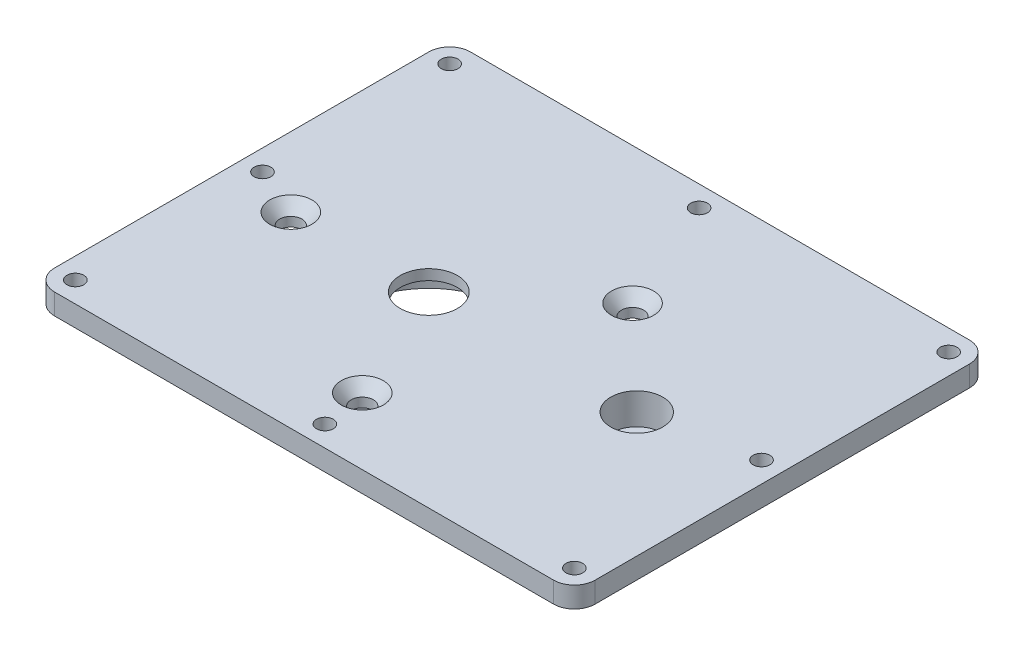
ISO-10303-21;
HEADER;
FILE_DESCRIPTION(('STEP AP214'),'2;1');
FILE_NAME('part.step','',(''),(''),'','','');
FILE_SCHEMA(('AUTOMOTIVE_DESIGN { 1 0 10303 214 1 1 1 1 }'));
ENDSEC;
DATA;
#1=APPLICATION_CONTEXT('core data for automotive mechanical design processes');
#2=APPLICATION_PROTOCOL_DEFINITION('international standard','automotive_design',2000,#1);
#3=PRODUCT_CONTEXT('',#1,'mechanical');
#4=PRODUCT('Part','Part','',(#3));
#5=PRODUCT_RELATED_PRODUCT_CATEGORY('part','',(#4));
#6=PRODUCT_DEFINITION_FORMATION('','',#4);
#7=PRODUCT_DEFINITION_CONTEXT('part definition',#1,'design');
#8=PRODUCT_DEFINITION('design','',#6,#7);
#9=PRODUCT_DEFINITION_SHAPE('','',#8);
#10=(LENGTH_UNIT() NAMED_UNIT(*) SI_UNIT(.MILLI.,.METRE.));
#11=(NAMED_UNIT(*) PLANE_ANGLE_UNIT() SI_UNIT($,.RADIAN.));
#12=(NAMED_UNIT(*) SI_UNIT($,.STERADIAN.) SOLID_ANGLE_UNIT());
#13=UNCERTAINTY_MEASURE_WITH_UNIT(LENGTH_MEASURE(1.E-05),#10,'distance_accuracy_value','');
#14=(GEOMETRIC_REPRESENTATION_CONTEXT(3) GLOBAL_UNCERTAINTY_ASSIGNED_CONTEXT((#13)) GLOBAL_UNIT_ASSIGNED_CONTEXT((#10,
#11,#12)) REPRESENTATION_CONTEXT('',''));
#15=CARTESIAN_POINT('',(0.,0.,0.));
#16=DIRECTION('',(0.,0.,1.));
#17=DIRECTION('',(1.,0.,0.));
#18=AXIS2_PLACEMENT_3D('',#15,#16,#17);
#19=CARTESIAN_POINT('',(44.45,6.35,6.35));
#20=DIRECTION('',(0.,-1.,0.));
#21=DIRECTION('',(0.,0.,-1.));
#22=AXIS2_PLACEMENT_3D('',#19,#20,#21);
#23=CYLINDRICAL_SURFACE('',#22,7.9375);
#24=CARTESIAN_POINT('',(44.45,6.35,6.35));
#25=DIRECTION('',(0.,1.,0.));
#26=DIRECTION('',(0.,0.,1.));
#27=AXIS2_PLACEMENT_3D('',#24,#25,#26);
#28=CIRCLE('',#27,7.9375);
#29=CARTESIAN_POINT('',(44.45,6.35,14.2875));
#30=VERTEX_POINT('',#29);
#31=EDGE_CURVE('E142',#30,#30,#28,.T.);
#32=ORIENTED_EDGE('',*,*,#31,.T.);
#33=EDGE_LOOP('',(#32));
#34=FACE_BOUND('',#33,.T.);
#35=CARTESIAN_POINT('',(44.45,-3.175,6.35));
#36=DIRECTION('',(0.,-1.,0.));
#37=DIRECTION('',(0.,0.,-1.));
#38=AXIS2_PLACEMENT_3D('',#35,#36,#37);
#39=CIRCLE('',#38,7.9375);
#40=CARTESIAN_POINT('',(44.45,-3.175,-1.5875));
#41=VERTEX_POINT('',#40);
#42=EDGE_CURVE('E151',#41,#41,#39,.T.);
#43=ORIENTED_EDGE('',*,*,#42,.T.);
#44=EDGE_LOOP('',(#43));
#45=FACE_BOUND('',#44,.T.);
#46=ADVANCED_FACE('F36',(#34,#45),#23,.F.);
#47=CARTESIAN_POINT('',(0.,6.35,0.));
#48=DIRECTION('',(0.,1.,0.));
#49=DIRECTION('',(0.,0.,1.));
#50=AXIS2_PLACEMENT_3D('',#47,#48,#49);
#51=PLANE('',#50);
#52=CARTESIAN_POINT('',(-76.2,6.35,57.15));
#53=DIRECTION('',(0.,1.,0.));
#54=DIRECTION('',(0.,0.,1.));
#55=AXIS2_PLACEMENT_3D('',#52,#53,#54);
#56=CIRCLE('',#55,2.55269999999999);
#57=CARTESIAN_POINT('',(-76.2,6.35,59.7027));
#58=VERTEX_POINT('',#57);
#59=EDGE_CURVE('E410',#58,#58,#56,.T.);
#60=ORIENTED_EDGE('',*,*,#59,.F.);
#61=EDGE_LOOP('',(#60));
#62=FACE_BOUND('',#61,.T.);
#63=CARTESIAN_POINT('',(-76.2,6.35,-57.15));
#64=DIRECTION('',(0.,1.,0.));
#65=DIRECTION('',(0.,0.,1.));
#66=AXIS2_PLACEMENT_3D('',#63,#64,#65);
#67=CIRCLE('',#66,2.55269999999999);
#68=CARTESIAN_POINT('',(-76.2,6.35,-54.5973));
#69=VERTEX_POINT('',#68);
#70=EDGE_CURVE('E411',#69,#69,#67,.T.);
#71=ORIENTED_EDGE('',*,*,#70,.F.);
#72=EDGE_LOOP('',(#71));
#73=FACE_BOUND('',#72,.T.);
#74=CARTESIAN_POINT('',(76.2,6.35,-57.15));
#75=DIRECTION('',(0.,1.,0.));
#76=DIRECTION('',(0.,0.,1.));
#77=AXIS2_PLACEMENT_3D('',#74,#75,#76);
#78=CIRCLE('',#77,2.55269999999999);
#79=CARTESIAN_POINT('',(76.2,6.35,-54.5973));
#80=VERTEX_POINT('',#79);
#81=EDGE_CURVE('E418',#80,#80,#78,.T.);
#82=ORIENTED_EDGE('',*,*,#81,.F.);
#83=EDGE_LOOP('',(#82));
#84=FACE_BOUND('',#83,.T.);
#85=CARTESIAN_POINT('',(76.2,6.35,57.15));
#86=DIRECTION('',(0.,1.,0.));
#87=DIRECTION('',(0.,0.,1.));
#88=AXIS2_PLACEMENT_3D('',#85,#86,#87);
#89=CIRCLE('',#88,2.55269999999999);
#90=CARTESIAN_POINT('',(76.2,6.35,59.7027));
#91=VERTEX_POINT('',#90);
#92=EDGE_CURVE('E422',#91,#91,#89,.T.);
#93=ORIENTED_EDGE('',*,*,#92,.F.);
#94=EDGE_LOOP('',(#93));
#95=FACE_BOUND('',#94,.T.);
#96=CARTESIAN_POINT('',(0.,6.35,-57.15));
#97=DIRECTION('',(0.,1.,0.));
#98=DIRECTION('',(0.,0.,1.));
#99=AXIS2_PLACEMENT_3D('',#96,#97,#98);
#100=CIRCLE('',#99,2.5527);
#101=CARTESIAN_POINT('',(0.,6.35,-54.5973));
#102=VERTEX_POINT('',#101);
#103=EDGE_CURVE('E426',#102,#102,#100,.T.);
#104=ORIENTED_EDGE('',*,*,#103,.F.);
#105=EDGE_LOOP('',(#104));
#106=FACE_BOUND('',#105,.T.);
#107=CARTESIAN_POINT('',(0.,6.35,57.15));
#108=DIRECTION('',(0.,1.,0.));
#109=DIRECTION('',(0.,0.,1.));
#110=AXIS2_PLACEMENT_3D('',#107,#108,#109);
#111=CIRCLE('',#110,2.5527);
#112=CARTESIAN_POINT('',(0.,6.35,59.7027));
#113=VERTEX_POINT('',#112);
#114=EDGE_CURVE('E429',#113,#113,#111,.T.);
#115=ORIENTED_EDGE('',*,*,#114,.F.);
#116=EDGE_LOOP('',(#115));
#117=FACE_BOUND('',#116,.T.);
#118=CARTESIAN_POINT('',(-76.2,6.35,0.));
#119=DIRECTION('',(0.,1.,0.));
#120=DIRECTION('',(0.,0.,1.));
#121=AXIS2_PLACEMENT_3D('',#118,#119,#120);
#122=CIRCLE('',#121,2.55269999999999);
#123=CARTESIAN_POINT('',(-76.2,6.35,2.55270000000001));
#124=VERTEX_POINT('',#123);
#125=EDGE_CURVE('E197',#124,#124,#122,.T.);
#126=ORIENTED_EDGE('',*,*,#125,.F.);
#127=EDGE_LOOP('',(#126));
#128=FACE_BOUND('',#127,.T.);
#129=CARTESIAN_POINT('',(76.2,6.35,0.));
#130=DIRECTION('',(0.,1.,0.));
#131=DIRECTION('',(0.,0.,1.));
#132=AXIS2_PLACEMENT_3D('',#129,#130,#131);
#133=CIRCLE('',#132,2.55269999999999);
#134=CARTESIAN_POINT('',(76.2,6.35,2.55269999999998));
#135=VERTEX_POINT('',#134);
#136=EDGE_CURVE('E186',#135,#135,#133,.T.);
#137=ORIENTED_EDGE('',*,*,#136,.F.);
#138=EDGE_LOOP('',(#137));
#139=FACE_BOUND('',#138,.T.);
#140=CARTESIAN_POINT('',(-61.2556864717363,6.35,6.29123306272272));
#141=DIRECTION('',(0.,1.,0.));
#142=DIRECTION('',(0.,0.,1.));
#143=AXIS2_PLACEMENT_3D('',#140,#141,#142);
#144=CIRCLE('',#143,6.4389);
#145=CARTESIAN_POINT('',(-61.2556864717363,6.35,12.7301330627227));
#146=VERTEX_POINT('',#145);
#147=EDGE_CURVE('E185',#146,#146,#144,.T.);
#148=ORIENTED_EDGE('',*,*,#147,.F.);
#149=EDGE_LOOP('',(#148));
#150=FACE_BOUND('',#149,.T.);
#151=CARTESIAN_POINT('',(15.0155713082004,6.35,-21.8002894425893));
#152=DIRECTION('',(0.,1.,0.));
#153=DIRECTION('',(0.,0.,1.));
#154=AXIS2_PLACEMENT_3D('',#151,#152,#153);
#155=CIRCLE('',#154,6.4389);
#156=CARTESIAN_POINT('',(15.0155713082004,6.35,-15.3613894425893));
#157=VERTEX_POINT('',#156);
#158=EDGE_CURVE('E161',#157,#157,#155,.T.);
#159=ORIENTED_EDGE('',*,*,#158,.F.);
#160=EDGE_LOOP('',(#159));
#161=FACE_BOUND('',#160,.T.);
#162=CARTESIAN_POINT('',(-2.53999999999999,6.35,43.18));
#163=DIRECTION('',(0.,1.,0.));
#164=DIRECTION('',(0.,0.,1.));
#165=AXIS2_PLACEMENT_3D('',#162,#163,#164);
#166=CIRCLE('',#165,6.4389);
#167=CARTESIAN_POINT('',(-2.53999999999999,6.35,49.6189));
#168=VERTEX_POINT('',#167);
#169=EDGE_CURVE('E156',#168,#168,#166,.T.);
#170=ORIENTED_EDGE('',*,*,#169,.F.);
#171=EDGE_LOOP('',(#170));
#172=FACE_BOUND('',#171,.T.);
#173=CARTESIAN_POINT('',(-19.05,6.35,6.35));
#174=DIRECTION('',(0.,-1.,0.));
#175=DIRECTION('',(0.,0.,-1.));
#176=AXIS2_PLACEMENT_3D('',#173,#174,#175);
#177=CIRCLE('',#176,8.73125);
#178=CARTESIAN_POINT('',(-19.05,6.35,-2.38125));
#179=VERTEX_POINT('',#178);
#180=EDGE_CURVE('E222',#179,#179,#177,.T.);
#181=ORIENTED_EDGE('',*,*,#180,.T.);
#182=EDGE_LOOP('',(#181));
#183=FACE_BOUND('',#182,.T.);
#184=DIRECTION('',(0.,0.,-1.));
#185=VECTOR('',#184,1.);
#186=CARTESIAN_POINT('',(82.55,6.35,63.5));
#187=LINE('',#186,#185);
#188=CARTESIAN_POINT('',(82.55,6.35,57.15));
#189=VERTEX_POINT('',#188);
#190=CARTESIAN_POINT('',(82.55,6.35,-57.15));
#191=VERTEX_POINT('',#190);
#192=EDGE_CURVE('E233',#189,#191,#187,.T.);
#193=ORIENTED_EDGE('',*,*,#192,.T.);
#194=CARTESIAN_POINT('',(76.2,6.35,-57.15));
#195=DIRECTION('',(0.,1.,0.));
#196=DIRECTION('',(0.,0.,1.));
#197=AXIS2_PLACEMENT_3D('',#194,#195,#196);
#198=CIRCLE('',#197,6.35);
#199=CARTESIAN_POINT('',(76.2,6.35,-63.5));
#200=VERTEX_POINT('',#199);
#201=EDGE_CURVE('E176',#191,#200,#198,.T.);
#202=ORIENTED_EDGE('',*,*,#201,.T.);
#203=DIRECTION('',(-1.,0.,0.));
#204=VECTOR('',#203,1.);
#205=CARTESIAN_POINT('',(82.55,6.35,-63.5));
#206=LINE('',#205,#204);
#207=CARTESIAN_POINT('',(-76.2,6.35,-63.5));
#208=VERTEX_POINT('',#207);
#209=EDGE_CURVE('E124',#200,#208,#206,.T.);
#210=ORIENTED_EDGE('',*,*,#209,.T.);
#211=CARTESIAN_POINT('',(-76.2,6.35,-57.15));
#212=DIRECTION('',(0.,1.,0.));
#213=DIRECTION('',(0.,0.,1.));
#214=AXIS2_PLACEMENT_3D('',#211,#212,#213);
#215=CIRCLE('',#214,6.35);
#216=CARTESIAN_POINT('',(-82.55,6.35,-57.15));
#217=VERTEX_POINT('',#216);
#218=EDGE_CURVE('E171',#208,#217,#215,.T.);
#219=ORIENTED_EDGE('',*,*,#218,.T.);
#220=DIRECTION('',(0.,0.,1.));
#221=VECTOR('',#220,1.);
#222=CARTESIAN_POINT('',(-82.55,6.35,63.5));
#223=LINE('',#222,#221);
#224=CARTESIAN_POINT('',(-82.55,6.35,57.15));
#225=VERTEX_POINT('',#224);
#226=EDGE_CURVE('E130',#217,#225,#223,.T.);
#227=ORIENTED_EDGE('',*,*,#226,.T.);
#228=CARTESIAN_POINT('',(-76.2,6.35,57.15));
#229=DIRECTION('',(0.,1.,0.));
#230=DIRECTION('',(0.,0.,1.));
#231=AXIS2_PLACEMENT_3D('',#228,#229,#230);
#232=CIRCLE('',#231,6.35);
#233=CARTESIAN_POINT('',(-76.2,6.35,63.5));
#234=VERTEX_POINT('',#233);
#235=EDGE_CURVE('E60',#225,#234,#232,.T.);
#236=ORIENTED_EDGE('',*,*,#235,.T.);
#237=DIRECTION('',(1.,0.,0.));
#238=VECTOR('',#237,1.);
#239=CARTESIAN_POINT('',(82.55,6.35,63.5));
#240=LINE('',#239,#238);
#241=CARTESIAN_POINT('',(76.2,6.35,63.5));
#242=VERTEX_POINT('',#241);
#243=EDGE_CURVE('E133',#234,#242,#240,.T.);
#244=ORIENTED_EDGE('',*,*,#243,.T.);
#245=CARTESIAN_POINT('',(76.2,6.35,57.15));
#246=DIRECTION('',(0.,1.,0.));
#247=DIRECTION('',(0.,0.,1.));
#248=AXIS2_PLACEMENT_3D('',#245,#246,#247);
#249=CIRCLE('',#248,6.35);
#250=EDGE_CURVE('E174',#242,#189,#249,.T.);
#251=ORIENTED_EDGE('',*,*,#250,.T.);
#252=EDGE_LOOP('',(#193,#202,#210,#219,#227,#236,#244,#251));
#253=FACE_BOUND('',#252,.T.);
#254=ORIENTED_EDGE('',*,*,#31,.F.);
#255=EDGE_LOOP('',(#254));
#256=FACE_BOUND('',#255,.T.);
#257=ADVANCED_FACE('F246',(#62,#73,#84,#95,#106,#117,#128,#139,#150,#161,#172,#183,#253,#256),
#51,.T.);
#258=CARTESIAN_POINT('',(0.,0.,0.));
#259=DIRECTION('',(0.,1.,0.));
#260=DIRECTION('',(0.,0.,1.));
#261=AXIS2_PLACEMENT_3D('',#258,#259,#260);
#262=PLANE('',#261);
#263=CARTESIAN_POINT('',(-76.2,0.,57.15));
#264=DIRECTION('',(0.,1.,0.));
#265=DIRECTION('',(0.,0.,1.));
#266=AXIS2_PLACEMENT_3D('',#263,#264,#265);
#267=CIRCLE('',#266,2.55269999999999);
#268=CARTESIAN_POINT('',(-76.2,0.,59.7027));
#269=VERTEX_POINT('',#268);
#270=EDGE_CURVE('E282',#269,#269,#267,.T.);
#271=ORIENTED_EDGE('',*,*,#270,.T.);
#272=EDGE_LOOP('',(#271));
#273=FACE_BOUND('',#272,.T.);
#274=CARTESIAN_POINT('',(-76.2,0.,-57.15));
#275=DIRECTION('',(0.,1.,0.));
#276=DIRECTION('',(0.,0.,1.));
#277=AXIS2_PLACEMENT_3D('',#274,#275,#276);
#278=CIRCLE('',#277,2.55269999999999);
#279=CARTESIAN_POINT('',(-76.2,0.,-54.5973));
#280=VERTEX_POINT('',#279);
#281=EDGE_CURVE('E286',#280,#280,#278,.T.);
#282=ORIENTED_EDGE('',*,*,#281,.T.);
#283=EDGE_LOOP('',(#282));
#284=FACE_BOUND('',#283,.T.);
#285=CARTESIAN_POINT('',(76.2,0.,-57.15));
#286=DIRECTION('',(0.,1.,0.));
#287=DIRECTION('',(0.,0.,1.));
#288=AXIS2_PLACEMENT_3D('',#285,#286,#287);
#289=CIRCLE('',#288,2.55269999999999);
#290=CARTESIAN_POINT('',(76.2,0.,-54.5973));
#291=VERTEX_POINT('',#290);
#292=EDGE_CURVE('E290',#291,#291,#289,.T.);
#293=ORIENTED_EDGE('',*,*,#292,.T.);
#294=EDGE_LOOP('',(#293));
#295=FACE_BOUND('',#294,.T.);
#296=CARTESIAN_POINT('',(76.2,0.,57.15));
#297=DIRECTION('',(0.,1.,0.));
#298=DIRECTION('',(0.,0.,1.));
#299=AXIS2_PLACEMENT_3D('',#296,#297,#298);
#300=CIRCLE('',#299,2.55269999999999);
#301=CARTESIAN_POINT('',(76.2,0.,59.7027));
#302=VERTEX_POINT('',#301);
#303=EDGE_CURVE('E294',#302,#302,#300,.T.);
#304=ORIENTED_EDGE('',*,*,#303,.T.);
#305=EDGE_LOOP('',(#304));
#306=FACE_BOUND('',#305,.T.);
#307=CARTESIAN_POINT('',(0.,0.,-57.15));
#308=DIRECTION('',(0.,1.,0.));
#309=DIRECTION('',(0.,0.,1.));
#310=AXIS2_PLACEMENT_3D('',#307,#308,#309);
#311=CIRCLE('',#310,2.5527);
#312=CARTESIAN_POINT('',(0.,0.,-54.5973));
#313=VERTEX_POINT('',#312);
#314=EDGE_CURVE('E40',#313,#313,#311,.T.);
#315=ORIENTED_EDGE('',*,*,#314,.T.);
#316=EDGE_LOOP('',(#315));
#317=FACE_BOUND('',#316,.T.);
#318=CARTESIAN_POINT('',(0.,0.,57.15));
#319=DIRECTION('',(0.,1.,0.));
#320=DIRECTION('',(0.,0.,1.));
#321=AXIS2_PLACEMENT_3D('',#318,#319,#320);
#322=CIRCLE('',#321,2.5527);
#323=CARTESIAN_POINT('',(0.,0.,59.7027));
#324=VERTEX_POINT('',#323);
#325=EDGE_CURVE('E301',#324,#324,#322,.T.);
#326=ORIENTED_EDGE('',*,*,#325,.T.);
#327=EDGE_LOOP('',(#326));
#328=FACE_BOUND('',#327,.T.);
#329=CARTESIAN_POINT('',(-76.2,0.,0.));
#330=DIRECTION('',(0.,1.,0.));
#331=DIRECTION('',(0.,0.,1.));
#332=AXIS2_PLACEMENT_3D('',#329,#330,#331);
#333=CIRCLE('',#332,2.55269999999999);
#334=CARTESIAN_POINT('',(-76.2,0.,2.55270000000001));
#335=VERTEX_POINT('',#334);
#336=EDGE_CURVE('E192',#335,#335,#333,.T.);
#337=ORIENTED_EDGE('',*,*,#336,.T.);
#338=EDGE_LOOP('',(#337));
#339=FACE_BOUND('',#338,.T.);
#340=CARTESIAN_POINT('',(76.2,0.,0.));
#341=DIRECTION('',(0.,1.,0.));
#342=DIRECTION('',(0.,0.,1.));
#343=AXIS2_PLACEMENT_3D('',#340,#341,#342);
#344=CIRCLE('',#343,2.55269999999999);
#345=CARTESIAN_POINT('',(76.2,0.,2.55269999999998));
#346=VERTEX_POINT('',#345);
#347=EDGE_CURVE('E183',#346,#346,#344,.T.);
#348=ORIENTED_EDGE('',*,*,#347,.T.);
#349=EDGE_LOOP('',(#348));
#350=FACE_BOUND('',#349,.T.);
#351=CARTESIAN_POINT('',(-61.2556864717363,0.,6.29123306272272));
#352=DIRECTION('',(0.,1.,0.));
#353=DIRECTION('',(0.,0.,1.));
#354=AXIS2_PLACEMENT_3D('',#351,#352,#353);
#355=CIRCLE('',#354,3.3782);
#356=CARTESIAN_POINT('',(-61.2556864717363,0.,9.66943306272272));
#357=VERTEX_POINT('',#356);
#358=EDGE_CURVE('E158',#357,#357,#355,.T.);
#359=ORIENTED_EDGE('',*,*,#358,.T.);
#360=EDGE_LOOP('',(#359));
#361=FACE_BOUND('',#360,.T.);
#362=CARTESIAN_POINT('',(15.0155713082004,0.,-21.8002894425893));
#363=DIRECTION('',(0.,1.,0.));
#364=DIRECTION('',(0.,0.,1.));
#365=AXIS2_PLACEMENT_3D('',#362,#363,#364);
#366=CIRCLE('',#365,3.3782);
#367=CARTESIAN_POINT('',(15.0155713082004,0.,-18.4220894425893));
#368=VERTEX_POINT('',#367);
#369=EDGE_CURVE('E153',#368,#368,#366,.T.);
#370=ORIENTED_EDGE('',*,*,#369,.T.);
#371=EDGE_LOOP('',(#370));
#372=FACE_BOUND('',#371,.T.);
#373=CARTESIAN_POINT('',(-2.53999999999999,0.,43.18));
#374=DIRECTION('',(0.,1.,0.));
#375=DIRECTION('',(0.,0.,1.));
#376=AXIS2_PLACEMENT_3D('',#373,#374,#375);
#377=CIRCLE('',#376,3.3782);
#378=CARTESIAN_POINT('',(-2.53999999999999,0.,46.5582));
#379=VERTEX_POINT('',#378);
#380=EDGE_CURVE('E148',#379,#379,#377,.T.);
#381=ORIENTED_EDGE('',*,*,#380,.T.);
#382=EDGE_LOOP('',(#381));
#383=FACE_BOUND('',#382,.T.);
#384=CARTESIAN_POINT('',(44.45,0.,6.35));
#385=DIRECTION('',(0.,1.,0.));
#386=DIRECTION('',(0.,0.,1.));
#387=AXIS2_PLACEMENT_3D('',#384,#385,#386);
#388=CIRCLE('',#387,12.7);
#389=CARTESIAN_POINT('',(44.45,0.,19.05));
#390=VERTEX_POINT('',#389);
#391=EDGE_CURVE('E144',#390,#390,#388,.T.);
#392=ORIENTED_EDGE('',*,*,#391,.T.);
#393=EDGE_LOOP('',(#392));
#394=FACE_BOUND('',#393,.T.);
#395=CARTESIAN_POINT('',(-19.05,0.,6.35));
#396=DIRECTION('',(0.,1.,0.));
#397=DIRECTION('',(0.,0.,1.));
#398=AXIS2_PLACEMENT_3D('',#395,#396,#397);
#399=CIRCLE('',#398,28.575);
#400=CARTESIAN_POINT('',(-19.05,0.,34.925));
#401=VERTEX_POINT('',#400);
#402=EDGE_CURVE('E139',#401,#401,#399,.T.);
#403=ORIENTED_EDGE('',*,*,#402,.T.);
#404=EDGE_LOOP('',(#403));
#405=FACE_BOUND('',#404,.T.);
#406=DIRECTION('',(-1.,0.,0.));
#407=VECTOR('',#406,1.);
#408=CARTESIAN_POINT('',(82.55,0.,-63.5));
#409=LINE('',#408,#407);
#410=CARTESIAN_POINT('',(76.2,0.,-63.5));
#411=VERTEX_POINT('',#410);
#412=CARTESIAN_POINT('',(-76.2,0.,-63.5));
#413=VERTEX_POINT('',#412);
#414=EDGE_CURVE('E121',#411,#413,#409,.T.);
#415=ORIENTED_EDGE('',*,*,#414,.F.);
#416=CARTESIAN_POINT('',(76.2,0.,-57.15));
#417=DIRECTION('',(0.,1.,0.));
#418=DIRECTION('',(0.,0.,1.));
#419=AXIS2_PLACEMENT_3D('',#416,#417,#418);
#420=CIRCLE('',#419,6.35);
#421=CARTESIAN_POINT('',(82.55,0.,-57.15));
#422=VERTEX_POINT('',#421);
#423=EDGE_CURVE('E104',#411,#422,#420,.F.);
#424=ORIENTED_EDGE('',*,*,#423,.T.);
#425=DIRECTION('',(0.,0.,-1.));
#426=VECTOR('',#425,1.);
#427=CARTESIAN_POINT('',(82.55,0.,63.5));
#428=LINE('',#427,#426);
#429=CARTESIAN_POINT('',(82.55,0.,57.15));
#430=VERTEX_POINT('',#429);
#431=EDGE_CURVE('E131',#430,#422,#428,.T.);
#432=ORIENTED_EDGE('',*,*,#431,.F.);
#433=CARTESIAN_POINT('',(76.2,0.,57.15));
#434=DIRECTION('',(0.,1.,0.));
#435=DIRECTION('',(0.,0.,1.));
#436=AXIS2_PLACEMENT_3D('',#433,#434,#435);
#437=CIRCLE('',#436,6.35);
#438=CARTESIAN_POINT('',(76.2,0.,63.5));
#439=VERTEX_POINT('',#438);
#440=EDGE_CURVE('E115',#430,#439,#437,.F.);
#441=ORIENTED_EDGE('',*,*,#440,.T.);
#442=DIRECTION('',(1.,0.,0.));
#443=VECTOR('',#442,1.);
#444=CARTESIAN_POINT('',(82.55,0.,63.5));
#445=LINE('',#444,#443);
#446=CARTESIAN_POINT('',(-76.2,0.,63.5));
#447=VERTEX_POINT('',#446);
#448=EDGE_CURVE('E135',#447,#439,#445,.T.);
#449=ORIENTED_EDGE('',*,*,#448,.F.);
#450=CARTESIAN_POINT('',(-76.2,0.,57.15));
#451=DIRECTION('',(0.,1.,0.));
#452=DIRECTION('',(0.,0.,1.));
#453=AXIS2_PLACEMENT_3D('',#450,#451,#452);
#454=CIRCLE('',#453,6.35);
#455=CARTESIAN_POINT('',(-82.55,0.,57.15));
#456=VERTEX_POINT('',#455);
#457=EDGE_CURVE('E165',#447,#456,#454,.F.);
#458=ORIENTED_EDGE('',*,*,#457,.T.);
#459=DIRECTION('',(0.,0.,1.));
#460=VECTOR('',#459,1.);
#461=CARTESIAN_POINT('',(-82.55,0.,63.5));
#462=LINE('',#461,#460);
#463=CARTESIAN_POINT('',(-82.55,0.,-57.15));
#464=VERTEX_POINT('',#463);
#465=EDGE_CURVE('E230',#464,#456,#462,.T.);
#466=ORIENTED_EDGE('',*,*,#465,.F.);
#467=CARTESIAN_POINT('',(-76.2,0.,-57.15));
#468=DIRECTION('',(0.,1.,0.));
#469=DIRECTION('',(0.,0.,1.));
#470=AXIS2_PLACEMENT_3D('',#467,#468,#469);
#471=CIRCLE('',#470,6.35);
#472=EDGE_CURVE('E125',#464,#413,#471,.F.);
#473=ORIENTED_EDGE('',*,*,#472,.T.);
#474=EDGE_LOOP('',(#415,#424,#432,#441,#449,#458,#466,#473));
#475=FACE_BOUND('',#474,.T.);
#476=ADVANCED_FACE('F128',(#273,#284,#295,#306,#317,#328,#339,#350,#361,#372,#383,#394,#405,
#475),#262,.F.);
#477=CARTESIAN_POINT('',(-82.55,6.35,63.5));
#478=DIRECTION('',(1.,0.,0.));
#479=DIRECTION('',(0.,0.,-1.));
#480=AXIS2_PLACEMENT_3D('',#477,#478,#479);
#481=PLANE('',#480);
#482=ORIENTED_EDGE('',*,*,#465,.T.);
#483=DIRECTION('',(0.,-1.,0.));
#484=VECTOR('',#483,1.);
#485=CARTESIAN_POINT('',(-82.55,6.35,57.15));
#486=LINE('',#485,#484);
#487=EDGE_CURVE('E12',#456,#225,#486,.F.);
#488=ORIENTED_EDGE('',*,*,#487,.T.);
#489=ORIENTED_EDGE('',*,*,#226,.F.);
#490=DIRECTION('',(0.,-1.,0.));
#491=VECTOR('',#490,1.);
#492=CARTESIAN_POINT('',(-82.55,6.35,-57.15));
#493=LINE('',#492,#491);
#494=EDGE_CURVE('E45',#217,#464,#493,.T.);
#495=ORIENTED_EDGE('',*,*,#494,.T.);
#496=EDGE_LOOP('',(#482,#488,#489,#495));
#497=FACE_BOUND('',#496,.T.);
#498=ADVANCED_FACE('F258',(#497),#481,.F.);
#499=CARTESIAN_POINT('',(82.55,6.35,63.5));
#500=DIRECTION('',(0.,0.,-1.));
#501=DIRECTION('',(-1.,0.,0.));
#502=AXIS2_PLACEMENT_3D('',#499,#500,#501);
#503=PLANE('',#502);
#504=ORIENTED_EDGE('',*,*,#448,.T.);
#505=DIRECTION('',(0.,-1.,0.));
#506=VECTOR('',#505,1.);
#507=CARTESIAN_POINT('',(76.2,6.35,63.5));
#508=LINE('',#507,#506);
#509=EDGE_CURVE('E53',#439,#242,#508,.F.);
#510=ORIENTED_EDGE('',*,*,#509,.T.);
#511=ORIENTED_EDGE('',*,*,#243,.F.);
#512=DIRECTION('',(0.,-1.,0.));
#513=VECTOR('',#512,1.);
#514=CARTESIAN_POINT('',(-76.2,6.35,63.5));
#515=LINE('',#514,#513);
#516=EDGE_CURVE('E178',#234,#447,#515,.T.);
#517=ORIENTED_EDGE('',*,*,#516,.T.);
#518=EDGE_LOOP('',(#504,#510,#511,#517));
#519=FACE_BOUND('',#518,.T.);
#520=ADVANCED_FACE('F239',(#519),#503,.F.);
#521=CARTESIAN_POINT('',(82.55,6.35,63.5));
#522=DIRECTION('',(-1.,0.,0.));
#523=DIRECTION('',(0.,0.,1.));
#524=AXIS2_PLACEMENT_3D('',#521,#522,#523);
#525=PLANE('',#524);
#526=ORIENTED_EDGE('',*,*,#431,.T.);
#527=DIRECTION('',(0.,-1.,0.));
#528=VECTOR('',#527,1.);
#529=CARTESIAN_POINT('',(82.55,6.35,-57.15));
#530=LINE('',#529,#528);
#531=EDGE_CURVE('E109',#422,#191,#530,.F.);
#532=ORIENTED_EDGE('',*,*,#531,.T.);
#533=ORIENTED_EDGE('',*,*,#192,.F.);
#534=DIRECTION('',(0.,-1.,0.));
#535=VECTOR('',#534,1.);
#536=CARTESIAN_POINT('',(82.55,6.35,57.15));
#537=LINE('',#536,#535);
#538=EDGE_CURVE('E114',#189,#430,#537,.T.);
#539=ORIENTED_EDGE('',*,*,#538,.T.);
#540=EDGE_LOOP('',(#526,#532,#533,#539));
#541=FACE_BOUND('',#540,.T.);
#542=ADVANCED_FACE('F249',(#541),#525,.F.);
#543=CARTESIAN_POINT('',(82.55,6.35,-63.5));
#544=DIRECTION('',(0.,0.,1.));
#545=DIRECTION('',(1.,0.,0.));
#546=AXIS2_PLACEMENT_3D('',#543,#544,#545);
#547=PLANE('',#546);
#548=ORIENTED_EDGE('',*,*,#209,.F.);
#549=DIRECTION('',(0.,-1.,0.));
#550=VECTOR('',#549,1.);
#551=CARTESIAN_POINT('',(76.2,6.35,-63.5));
#552=LINE('',#551,#550);
#553=EDGE_CURVE('E108',#200,#411,#552,.T.);
#554=ORIENTED_EDGE('',*,*,#553,.T.);
#555=ORIENTED_EDGE('',*,*,#414,.T.);
#556=DIRECTION('',(0.,-1.,0.));
#557=VECTOR('',#556,1.);
#558=CARTESIAN_POINT('',(-76.2,6.35,-63.5));
#559=LINE('',#558,#557);
#560=EDGE_CURVE('E126',#413,#208,#559,.F.);
#561=ORIENTED_EDGE('',*,*,#560,.T.);
#562=EDGE_LOOP('',(#548,#554,#555,#561));
#563=FACE_BOUND('',#562,.T.);
#564=ADVANCED_FACE('F120',(#563),#547,.F.);
#565=CARTESIAN_POINT('',(-19.05,-9.525,6.35));
#566=DIRECTION('',(0.,1.,0.));
#567=DIRECTION('',(0.,0.,1.));
#568=AXIS2_PLACEMENT_3D('',#565,#566,#567);
#569=CYLINDRICAL_SURFACE('',#568,28.575);
#570=CARTESIAN_POINT('',(-19.05,-9.525,6.35));
#571=DIRECTION('',(0.,1.,0.));
#572=DIRECTION('',(0.,0.,1.));
#573=AXIS2_PLACEMENT_3D('',#570,#571,#572);
#574=CIRCLE('',#573,28.575);
#575=CARTESIAN_POINT('',(-19.05,-9.525,34.925));
#576=VERTEX_POINT('',#575);
#577=EDGE_CURVE('E143',#576,#576,#574,.T.);
#578=ORIENTED_EDGE('',*,*,#577,.T.);
#579=EDGE_LOOP('',(#578));
#580=FACE_BOUND('',#579,.T.);
#581=ORIENTED_EDGE('',*,*,#402,.F.);
#582=EDGE_LOOP('',(#581));
#583=FACE_BOUND('',#582,.T.);
#584=ADVANCED_FACE('F256',(#580,#583),#569,.T.);
#585=CARTESIAN_POINT('',(-19.05,-9.525,6.35));
#586=DIRECTION('',(0.,1.,0.));
#587=DIRECTION('',(0.,0.,1.));
#588=AXIS2_PLACEMENT_3D('',#585,#586,#587);
#589=PLANE('',#588);
#590=CARTESIAN_POINT('',(-19.05,-9.525,6.35));
#591=DIRECTION('',(0.,-1.,0.));
#592=DIRECTION('',(0.,0.,-1.));
#593=AXIS2_PLACEMENT_3D('',#590,#591,#592);
#594=CIRCLE('',#593,23.8125);
#595=CARTESIAN_POINT('',(-19.05,-9.525,-17.4625));
#596=VERTEX_POINT('',#595);
#597=EDGE_CURVE('E213',#596,#596,#594,.T.);
#598=ORIENTED_EDGE('',*,*,#597,.F.);
#599=EDGE_LOOP('',(#598));
#600=FACE_BOUND('',#599,.T.);
#601=ORIENTED_EDGE('',*,*,#577,.F.);
#602=EDGE_LOOP('',(#601));
#603=FACE_BOUND('',#602,.T.);
#604=ADVANCED_FACE('F315',(#600,#603),#589,.F.);
#605=CARTESIAN_POINT('',(44.45,-9.525,6.35));
#606=DIRECTION('',(0.,1.,0.));
#607=DIRECTION('',(0.,0.,1.));
#608=AXIS2_PLACEMENT_3D('',#605,#606,#607);
#609=CYLINDRICAL_SURFACE('',#608,12.7);
#610=CARTESIAN_POINT('',(44.45,-9.525,6.35));
#611=DIRECTION('',(0.,1.,0.));
#612=DIRECTION('',(0.,0.,1.));
#613=AXIS2_PLACEMENT_3D('',#610,#611,#612);
#614=CIRCLE('',#613,12.7);
#615=CARTESIAN_POINT('',(44.45,-9.525,19.05));
#616=VERTEX_POINT('',#615);
#617=EDGE_CURVE('E147',#616,#616,#614,.T.);
#618=ORIENTED_EDGE('',*,*,#617,.T.);
#619=EDGE_LOOP('',(#618));
#620=FACE_BOUND('',#619,.T.);
#621=ORIENTED_EDGE('',*,*,#391,.F.);
#622=EDGE_LOOP('',(#621));
#623=FACE_BOUND('',#622,.T.);
#624=ADVANCED_FACE('F320',(#620,#623),#609,.T.);
#625=CARTESIAN_POINT('',(44.45,-9.525,6.35));
#626=DIRECTION('',(0.,1.,0.));
#627=DIRECTION('',(0.,0.,1.));
#628=AXIS2_PLACEMENT_3D('',#625,#626,#627);
#629=PLANE('',#628);
#630=ORIENTED_EDGE('',*,*,#617,.F.);
#631=EDGE_LOOP('',(#630));
#632=FACE_BOUND('',#631,.T.);
#633=ADVANCED_FACE('F327',(#632),#629,.F.);
#634=CARTESIAN_POINT('',(-19.05,3.175,6.35));
#635=DIRECTION('',(0.,1.,0.));
#636=DIRECTION('',(0.,0.,1.));
#637=AXIS2_PLACEMENT_3D('',#634,#635,#636);
#638=CYLINDRICAL_SURFACE('',#637,8.73125);
#639=CARTESIAN_POINT('',(-19.05,3.175,6.35));
#640=DIRECTION('',(0.,-1.,0.));
#641=DIRECTION('',(0.,0.,-1.));
#642=AXIS2_PLACEMENT_3D('',#639,#640,#641);
#643=CIRCLE('',#642,8.73125);
#644=CARTESIAN_POINT('',(-19.05,3.175,-2.38125));
#645=VERTEX_POINT('',#644);
#646=EDGE_CURVE('E217',#645,#645,#643,.T.);
#647=ORIENTED_EDGE('',*,*,#646,.T.);
#648=EDGE_LOOP('',(#647));
#649=FACE_BOUND('',#648,.T.);
#650=ORIENTED_EDGE('',*,*,#180,.F.);
#651=EDGE_LOOP('',(#650));
#652=FACE_BOUND('',#651,.T.);
#653=ADVANCED_FACE('F334',(#649,#652),#638,.F.);
#654=CARTESIAN_POINT('',(-19.05,3.175,6.35));
#655=DIRECTION('',(0.,-1.,0.));
#656=DIRECTION('',(0.,0.,-1.));
#657=AXIS2_PLACEMENT_3D('',#654,#655,#656);
#658=CYLINDRICAL_SURFACE('',#657,23.8125);
#659=CARTESIAN_POINT('',(-19.05,3.175,6.35));
#660=DIRECTION('',(0.,-1.,0.));
#661=DIRECTION('',(0.,0.,-1.));
#662=AXIS2_PLACEMENT_3D('',#659,#660,#661);
#663=CIRCLE('',#662,23.8125);
#664=CARTESIAN_POINT('',(-19.05,3.175,-17.4625));
#665=VERTEX_POINT('',#664);
#666=EDGE_CURVE('E214',#665,#665,#663,.T.);
#667=ORIENTED_EDGE('',*,*,#666,.F.);
#668=EDGE_LOOP('',(#667));
#669=FACE_BOUND('',#668,.T.);
#670=ORIENTED_EDGE('',*,*,#597,.T.);
#671=EDGE_LOOP('',(#670));
#672=FACE_BOUND('',#671,.T.);
#673=ADVANCED_FACE('F338',(#669,#672),#658,.F.);
#674=CARTESIAN_POINT('',(-19.05,3.175,6.35));
#675=DIRECTION('',(0.,-1.,0.));
#676=DIRECTION('',(0.,0.,-1.));
#677=AXIS2_PLACEMENT_3D('',#674,#675,#676);
#678=PLANE('',#677);
#679=ORIENTED_EDGE('',*,*,#646,.F.);
#680=EDGE_LOOP('',(#679));
#681=FACE_BOUND('',#680,.T.);
#682=ORIENTED_EDGE('',*,*,#666,.T.);
#683=EDGE_LOOP('',(#682));
#684=FACE_BOUND('',#683,.T.);
#685=ADVANCED_FACE('F342',(#681,#684),#678,.T.);
#686=CARTESIAN_POINT('',(44.45,-3.175,6.35));
#687=DIRECTION('',(0.,-1.,0.));
#688=DIRECTION('',(0.,0.,-1.));
#689=AXIS2_PLACEMENT_3D('',#686,#687,#688);
#690=PLANE('',#689);
#691=ORIENTED_EDGE('',*,*,#42,.F.);
#692=EDGE_LOOP('',(#691));
#693=FACE_BOUND('',#692,.T.);
#694=ADVANCED_FACE('F346',(#693),#690,.F.);
#695=CARTESIAN_POINT('',(-2.53999999999999,6.35,43.18));
#696=DIRECTION('',(0.,1.,0.));
#697=DIRECTION('',(0.,0.,1.));
#698=AXIS2_PLACEMENT_3D('',#695,#696,#697);
#699=CYLINDRICAL_SURFACE('',#698,3.3782);
#700=CARTESIAN_POINT('',(-2.53999999999999,2.82906741601866,43.18));
#701=DIRECTION('',(0.,1.,0.));
#702=DIRECTION('',(0.,0.,1.));
#703=AXIS2_PLACEMENT_3D('',#700,#701,#702);
#704=CIRCLE('',#703,3.3782);
#705=CARTESIAN_POINT('',(-2.53999999999999,2.82906741601866,46.5582));
#706=VERTEX_POINT('',#705);
#707=EDGE_CURVE('E152',#706,#706,#704,.T.);
#708=ORIENTED_EDGE('',*,*,#707,.T.);
#709=EDGE_LOOP('',(#708));
#710=FACE_BOUND('',#709,.T.);
#711=ORIENTED_EDGE('',*,*,#380,.F.);
#712=EDGE_LOOP('',(#711));
#713=FACE_BOUND('',#712,.T.);
#714=ADVANCED_FACE('F350',(#710,#713),#699,.F.);
#715=CARTESIAN_POINT('',(-2.53999999999999,6.35,43.18));
#716=DIRECTION('',(0.,1.,0.));
#717=DIRECTION('',(0.,0.,1.));
#718=AXIS2_PLACEMENT_3D('',#715,#716,#717);
#719=CONICAL_SURFACE('',#718,6.4389,0.715584993317675);
#720=ORIENTED_EDGE('',*,*,#707,.F.);
#721=EDGE_LOOP('',(#720));
#722=FACE_BOUND('',#721,.T.);
#723=ORIENTED_EDGE('',*,*,#169,.T.);
#724=EDGE_LOOP('',(#723));
#725=FACE_BOUND('',#724,.T.);
#726=ADVANCED_FACE('F354',(#722,#725),#719,.F.);
#727=CARTESIAN_POINT('',(15.0155713082004,6.35,-21.8002894425893));
#728=DIRECTION('',(0.,1.,0.));
#729=DIRECTION('',(0.,0.,1.));
#730=AXIS2_PLACEMENT_3D('',#727,#728,#729);
#731=CYLINDRICAL_SURFACE('',#730,3.3782);
#732=CARTESIAN_POINT('',(15.0155713082004,2.82906741601866,-21.8002894425893));
#733=DIRECTION('',(0.,1.,0.));
#734=DIRECTION('',(0.,0.,1.));
#735=AXIS2_PLACEMENT_3D('',#732,#733,#734);
#736=CIRCLE('',#735,3.3782);
#737=CARTESIAN_POINT('',(15.0155713082004,2.82906741601866,-18.4220894425893));
#738=VERTEX_POINT('',#737);
#739=EDGE_CURVE('E157',#738,#738,#736,.T.);
#740=ORIENTED_EDGE('',*,*,#739,.T.);
#741=EDGE_LOOP('',(#740));
#742=FACE_BOUND('',#741,.T.);
#743=ORIENTED_EDGE('',*,*,#369,.F.);
#744=EDGE_LOOP('',(#743));
#745=FACE_BOUND('',#744,.T.);
#746=ADVANCED_FACE('F358',(#742,#745),#731,.F.);
#747=CARTESIAN_POINT('',(15.0155713082004,6.35,-21.8002894425893));
#748=DIRECTION('',(0.,1.,0.));
#749=DIRECTION('',(0.,0.,1.));
#750=AXIS2_PLACEMENT_3D('',#747,#748,#749);
#751=CONICAL_SURFACE('',#750,6.4389,0.715584993317676);
#752=ORIENTED_EDGE('',*,*,#739,.F.);
#753=EDGE_LOOP('',(#752));
#754=FACE_BOUND('',#753,.T.);
#755=ORIENTED_EDGE('',*,*,#158,.T.);
#756=EDGE_LOOP('',(#755));
#757=FACE_BOUND('',#756,.T.);
#758=ADVANCED_FACE('F362',(#754,#757),#751,.F.);
#759=CARTESIAN_POINT('',(-61.2556864717363,6.35,6.29123306272272));
#760=DIRECTION('',(0.,1.,0.));
#761=DIRECTION('',(0.,0.,1.));
#762=AXIS2_PLACEMENT_3D('',#759,#760,#761);
#763=CYLINDRICAL_SURFACE('',#762,3.3782);
#764=CARTESIAN_POINT('',(-61.2556864717363,2.82906741601866,6.29123306272272));
#765=DIRECTION('',(0.,1.,0.));
#766=DIRECTION('',(0.,0.,1.));
#767=AXIS2_PLACEMENT_3D('',#764,#765,#766);
#768=CIRCLE('',#767,3.3782);
#769=CARTESIAN_POINT('',(-61.2556864717363,2.82906741601866,9.66943306272272));
#770=VERTEX_POINT('',#769);
#771=EDGE_CURVE('E162',#770,#770,#768,.T.);
#772=ORIENTED_EDGE('',*,*,#771,.T.);
#773=EDGE_LOOP('',(#772));
#774=FACE_BOUND('',#773,.T.);
#775=ORIENTED_EDGE('',*,*,#358,.F.);
#776=EDGE_LOOP('',(#775));
#777=FACE_BOUND('',#776,.T.);
#778=ADVANCED_FACE('F366',(#774,#777),#763,.F.);
#779=CARTESIAN_POINT('',(-61.2556864717363,6.35,6.29123306272272));
#780=DIRECTION('',(0.,1.,0.));
#781=DIRECTION('',(0.,0.,1.));
#782=AXIS2_PLACEMENT_3D('',#779,#780,#781);
#783=CONICAL_SURFACE('',#782,6.4389,0.715584993317675);
#784=ORIENTED_EDGE('',*,*,#771,.F.);
#785=EDGE_LOOP('',(#784));
#786=FACE_BOUND('',#785,.T.);
#787=ORIENTED_EDGE('',*,*,#147,.T.);
#788=EDGE_LOOP('',(#787));
#789=FACE_BOUND('',#788,.T.);
#790=ADVANCED_FACE('F370',(#786,#789),#783,.F.);
#791=CARTESIAN_POINT('',(76.2,6.35,-57.15));
#792=DIRECTION('',(0.,-1.,0.));
#793=DIRECTION('',(0.,0.,-1.));
#794=AXIS2_PLACEMENT_3D('',#791,#792,#793);
#795=CYLINDRICAL_SURFACE('',#794,6.35);
#796=ORIENTED_EDGE('',*,*,#201,.F.);
#797=ORIENTED_EDGE('',*,*,#531,.F.);
#798=ORIENTED_EDGE('',*,*,#423,.F.);
#799=ORIENTED_EDGE('',*,*,#553,.F.);
#800=EDGE_LOOP('',(#796,#797,#798,#799));
#801=FACE_BOUND('',#800,.T.);
#802=ADVANCED_FACE('F107',(#801),#795,.T.);
#803=CARTESIAN_POINT('',(76.2,6.35,57.15));
#804=DIRECTION('',(0.,-1.,0.));
#805=DIRECTION('',(0.,0.,-1.));
#806=AXIS2_PLACEMENT_3D('',#803,#804,#805);
#807=CYLINDRICAL_SURFACE('',#806,6.35);
#808=ORIENTED_EDGE('',*,*,#250,.F.);
#809=ORIENTED_EDGE('',*,*,#509,.F.);
#810=ORIENTED_EDGE('',*,*,#440,.F.);
#811=ORIENTED_EDGE('',*,*,#538,.F.);
#812=EDGE_LOOP('',(#808,#809,#810,#811));
#813=FACE_BOUND('',#812,.T.);
#814=ADVANCED_FACE('F243',(#813),#807,.T.);
#815=CARTESIAN_POINT('',(-76.2,6.35,57.15));
#816=DIRECTION('',(0.,-1.,0.));
#817=DIRECTION('',(0.,0.,-1.));
#818=AXIS2_PLACEMENT_3D('',#815,#816,#817);
#819=CYLINDRICAL_SURFACE('',#818,6.35);
#820=ORIENTED_EDGE('',*,*,#235,.F.);
#821=ORIENTED_EDGE('',*,*,#487,.F.);
#822=ORIENTED_EDGE('',*,*,#457,.F.);
#823=ORIENTED_EDGE('',*,*,#516,.F.);
#824=EDGE_LOOP('',(#820,#821,#822,#823));
#825=FACE_BOUND('',#824,.T.);
#826=ADVANCED_FACE('F498',(#825),#819,.T.);
#827=CARTESIAN_POINT('',(-76.2,6.35,-57.15));
#828=DIRECTION('',(0.,-1.,0.));
#829=DIRECTION('',(0.,0.,-1.));
#830=AXIS2_PLACEMENT_3D('',#827,#828,#829);
#831=CYLINDRICAL_SURFACE('',#830,6.35);
#832=ORIENTED_EDGE('',*,*,#218,.F.);
#833=ORIENTED_EDGE('',*,*,#560,.F.);
#834=ORIENTED_EDGE('',*,*,#472,.F.);
#835=ORIENTED_EDGE('',*,*,#494,.F.);
#836=EDGE_LOOP('',(#832,#833,#834,#835));
#837=FACE_BOUND('',#836,.T.);
#838=ADVANCED_FACE('F38',(#837),#831,.T.);
#839=CARTESIAN_POINT('',(76.2,6.35,0.));
#840=DIRECTION('',(0.,1.,0.));
#841=DIRECTION('',(0.,0.,1.));
#842=AXIS2_PLACEMENT_3D('',#839,#840,#841);
#843=CYLINDRICAL_SURFACE('',#842,2.55269999999999);
#844=ORIENTED_EDGE('',*,*,#136,.T.);
#845=EDGE_LOOP('',(#844));
#846=FACE_BOUND('',#845,.T.);
#847=ORIENTED_EDGE('',*,*,#347,.F.);
#848=EDGE_LOOP('',(#847));
#849=FACE_BOUND('',#848,.T.);
#850=ADVANCED_FACE('F375',(#846,#849),#843,.F.);
#851=CARTESIAN_POINT('',(-76.2,6.35,0.));
#852=DIRECTION('',(0.,1.,0.));
#853=DIRECTION('',(0.,0.,1.));
#854=AXIS2_PLACEMENT_3D('',#851,#852,#853);
#855=CYLINDRICAL_SURFACE('',#854,2.55269999999999);
#856=ORIENTED_EDGE('',*,*,#125,.T.);
#857=EDGE_LOOP('',(#856));
#858=FACE_BOUND('',#857,.T.);
#859=ORIENTED_EDGE('',*,*,#336,.F.);
#860=EDGE_LOOP('',(#859));
#861=FACE_BOUND('',#860,.T.);
#862=ADVANCED_FACE('F378',(#858,#861),#855,.F.);
#863=CARTESIAN_POINT('',(0.,6.35,57.15));
#864=DIRECTION('',(0.,1.,0.));
#865=DIRECTION('',(0.,0.,1.));
#866=AXIS2_PLACEMENT_3D('',#863,#864,#865);
#867=CYLINDRICAL_SURFACE('',#866,2.5527);
#868=ORIENTED_EDGE('',*,*,#114,.T.);
#869=EDGE_LOOP('',(#868));
#870=FACE_BOUND('',#869,.T.);
#871=ORIENTED_EDGE('',*,*,#325,.F.);
#872=EDGE_LOOP('',(#871));
#873=FACE_BOUND('',#872,.T.);
#874=ADVANCED_FACE('F381',(#870,#873),#867,.F.);
#875=CARTESIAN_POINT('',(0.,6.35,-57.15));
#876=DIRECTION('',(0.,1.,0.));
#877=DIRECTION('',(0.,0.,1.));
#878=AXIS2_PLACEMENT_3D('',#875,#876,#877);
#879=CYLINDRICAL_SURFACE('',#878,2.5527);
#880=ORIENTED_EDGE('',*,*,#103,.T.);
#881=EDGE_LOOP('',(#880));
#882=FACE_BOUND('',#881,.T.);
#883=ORIENTED_EDGE('',*,*,#314,.F.);
#884=EDGE_LOOP('',(#883));
#885=FACE_BOUND('',#884,.T.);
#886=ADVANCED_FACE('F385',(#882,#885),#879,.F.);
#887=CARTESIAN_POINT('',(76.2,6.35,57.15));
#888=DIRECTION('',(0.,1.,0.));
#889=DIRECTION('',(0.,0.,1.));
#890=AXIS2_PLACEMENT_3D('',#887,#888,#889);
#891=CYLINDRICAL_SURFACE('',#890,2.55269999999999);
#892=ORIENTED_EDGE('',*,*,#92,.T.);
#893=EDGE_LOOP('',(#892));
#894=FACE_BOUND('',#893,.T.);
#895=ORIENTED_EDGE('',*,*,#303,.F.);
#896=EDGE_LOOP('',(#895));
#897=FACE_BOUND('',#896,.T.);
#898=ADVANCED_FACE('F389',(#894,#897),#891,.F.);
#899=CARTESIAN_POINT('',(76.2,6.35,-57.15));
#900=DIRECTION('',(0.,1.,0.));
#901=DIRECTION('',(0.,0.,1.));
#902=AXIS2_PLACEMENT_3D('',#899,#900,#901);
#903=CYLINDRICAL_SURFACE('',#902,2.55269999999999);
#904=ORIENTED_EDGE('',*,*,#81,.T.);
#905=EDGE_LOOP('',(#904));
#906=FACE_BOUND('',#905,.T.);
#907=ORIENTED_EDGE('',*,*,#292,.F.);
#908=EDGE_LOOP('',(#907));
#909=FACE_BOUND('',#908,.T.);
#910=ADVANCED_FACE('F393',(#906,#909),#903,.F.);
#911=CARTESIAN_POINT('',(-76.2,6.35,-57.15));
#912=DIRECTION('',(0.,1.,0.));
#913=DIRECTION('',(0.,0.,1.));
#914=AXIS2_PLACEMENT_3D('',#911,#912,#913);
#915=CYLINDRICAL_SURFACE('',#914,2.55269999999999);
#916=ORIENTED_EDGE('',*,*,#70,.T.);
#917=EDGE_LOOP('',(#916));
#918=FACE_BOUND('',#917,.T.);
#919=ORIENTED_EDGE('',*,*,#281,.F.);
#920=EDGE_LOOP('',(#919));
#921=FACE_BOUND('',#920,.T.);
#922=ADVANCED_FACE('F397',(#918,#921),#915,.F.);
#923=CARTESIAN_POINT('',(-76.2,6.35,57.15));
#924=DIRECTION('',(0.,1.,0.));
#925=DIRECTION('',(0.,0.,1.));
#926=AXIS2_PLACEMENT_3D('',#923,#924,#925);
#927=CYLINDRICAL_SURFACE('',#926,2.55269999999999);
#928=ORIENTED_EDGE('',*,*,#59,.T.);
#929=EDGE_LOOP('',(#928));
#930=FACE_BOUND('',#929,.T.);
#931=ORIENTED_EDGE('',*,*,#270,.F.);
#932=EDGE_LOOP('',(#931));
#933=FACE_BOUND('',#932,.T.);
#934=ADVANCED_FACE('F401',(#930,#933),#927,.F.);
#935=CLOSED_SHELL('',(#46,#257,#476,#498,#520,#542,#564,#584,#604,#624,#633,#653,#673,#685,#694,
#714,#726,#746,#758,#778,#790,#802,#814,#826,#838,#850,#862,#874,#886,#898,#910,#922,#934));
#936=MANIFOLD_SOLID_BREP('B2',#935);
#937=ADVANCED_BREP_SHAPE_REPRESENTATION('',(#18,#936),#14);
#938=SHAPE_DEFINITION_REPRESENTATION(#9,#937);
ENDSEC;
END-ISO-10303-21;
